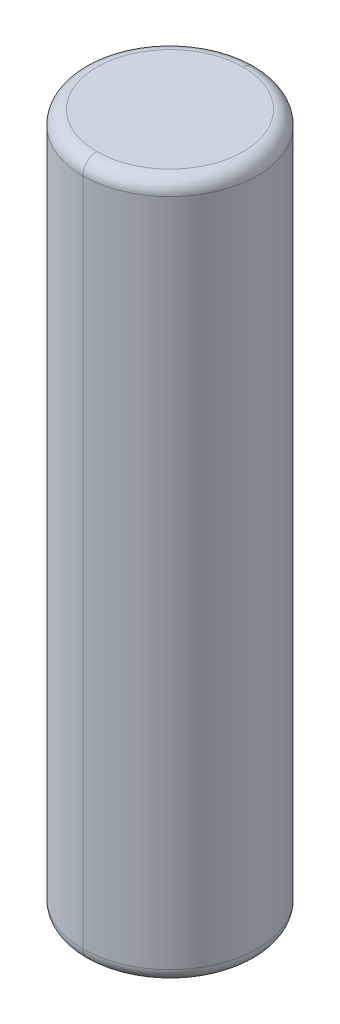
ISO-10303-21;
HEADER;
FILE_DESCRIPTION(('STEP AP214'),'2;1');
FILE_NAME('part.step','',(''),(''),'','','');
FILE_SCHEMA(('AUTOMOTIVE_DESIGN { 1 0 10303 214 1 1 1 1 }'));
ENDSEC;
DATA;
#1=APPLICATION_CONTEXT('core data for automotive mechanical design processes');
#2=APPLICATION_PROTOCOL_DEFINITION('international standard','automotive_design',2000,#1);
#3=PRODUCT_CONTEXT('',#1,'mechanical');
#4=PRODUCT('Part','Part','',(#3));
#5=PRODUCT_RELATED_PRODUCT_CATEGORY('part','',(#4));
#6=PRODUCT_DEFINITION_FORMATION('','',#4);
#7=PRODUCT_DEFINITION_CONTEXT('part definition',#1,'design');
#8=PRODUCT_DEFINITION('design','',#6,#7);
#9=PRODUCT_DEFINITION_SHAPE('','',#8);
#10=(LENGTH_UNIT() NAMED_UNIT(*) SI_UNIT(.MILLI.,.METRE.));
#11=(NAMED_UNIT(*) PLANE_ANGLE_UNIT() SI_UNIT($,.RADIAN.));
#12=(NAMED_UNIT(*) SI_UNIT($,.STERADIAN.) SOLID_ANGLE_UNIT());
#13=UNCERTAINTY_MEASURE_WITH_UNIT(LENGTH_MEASURE(1.E-05),#10,'distance_accuracy_value','');
#14=(GEOMETRIC_REPRESENTATION_CONTEXT(3) GLOBAL_UNCERTAINTY_ASSIGNED_CONTEXT((#13)) GLOBAL_UNIT_ASSIGNED_CONTEXT((#10,
#11,#12)) REPRESENTATION_CONTEXT('',''));
#15=CARTESIAN_POINT('',(0.,0.,0.));
#16=DIRECTION('',(0.,0.,1.));
#17=DIRECTION('',(1.,0.,0.));
#18=AXIS2_PLACEMENT_3D('',#15,#16,#17);
#19=CARTESIAN_POINT('',(0.,25.4,0.));
#20=DIRECTION('',(0.,-1.,0.));
#21=DIRECTION('',(0.,0.,-1.));
#22=AXIS2_PLACEMENT_3D('',#19,#20,#21);
#23=CYLINDRICAL_SURFACE('',#22,3.175);
#24=DIRECTION('',(0.,-1.,0.));
#25=VECTOR('',#24,1.);
#26=CARTESIAN_POINT('',(0.,25.4,3.175));
#27=LINE('',#26,#25);
#28=CARTESIAN_POINT('',(0.,24.892,3.175));
#29=VERTEX_POINT('',#28);
#30=CARTESIAN_POINT('',(0.,0.508000000000008,3.175));
#31=VERTEX_POINT('',#30);
#32=EDGE_CURVE('E118',#29,#31,#27,.T.);
#33=ORIENTED_EDGE('',*,*,#32,.F.);
#34=CARTESIAN_POINT('',(0.,24.892,0.));
#35=DIRECTION('',(0.,-1.,0.));
#36=DIRECTION('',(0.,0.,-1.));
#37=AXIS2_PLACEMENT_3D('',#34,#35,#36);
#38=CIRCLE('',#37,3.175);
#39=CARTESIAN_POINT('',(0.,24.892,-3.175));
#40=VERTEX_POINT('',#39);
#41=EDGE_CURVE('E74',#29,#40,#38,.T.);
#42=ORIENTED_EDGE('',*,*,#41,.T.);
#43=DIRECTION('',(0.,-1.,0.));
#44=VECTOR('',#43,1.);
#45=CARTESIAN_POINT('',(0.,25.4,-3.175));
#46=LINE('',#45,#44);
#47=CARTESIAN_POINT('',(0.,0.508000000000008,-3.175));
#48=VERTEX_POINT('',#47);
#49=EDGE_CURVE('E95',#40,#48,#46,.T.);
#50=ORIENTED_EDGE('',*,*,#49,.T.);
#51=CARTESIAN_POINT('',(0.,0.508000000000008,0.));
#52=DIRECTION('',(0.,-1.,0.));
#53=DIRECTION('',(0.,0.,-1.));
#54=AXIS2_PLACEMENT_3D('',#51,#52,#53);
#55=CIRCLE('',#54,3.175);
#56=EDGE_CURVE('E11',#31,#48,#55,.T.);
#57=ORIENTED_EDGE('',*,*,#56,.F.);
#58=EDGE_LOOP('',(#33,#42,#50,#57));
#59=FACE_BOUND('',#58,.T.);
#60=ADVANCED_FACE('F16',(#59),#23,.T.);
#61=CARTESIAN_POINT('',(0.,0.508000000000008,0.));
#62=DIRECTION('',(0.,-1.,0.));
#63=DIRECTION('',(0.,0.,-1.));
#64=AXIS2_PLACEMENT_3D('',#61,#62,#63);
#65=TOROIDAL_SURFACE('',#64,2.667,0.508);
#66=CARTESIAN_POINT('',(0.,0.508000000000008,2.667));
#67=DIRECTION('',(1.,0.,0.));
#68=DIRECTION('',(0.,0.,-1.));
#69=AXIS2_PLACEMENT_3D('',#66,#67,#68);
#70=CIRCLE('',#69,0.508);
#71=CARTESIAN_POINT('',(0.,0.,2.667));
#72=VERTEX_POINT('',#71);
#73=EDGE_CURVE('E83',#31,#72,#70,.T.);
#74=ORIENTED_EDGE('',*,*,#73,.F.);
#75=ORIENTED_EDGE('',*,*,#56,.T.);
#76=CARTESIAN_POINT('',(0.,0.508000000000008,-2.667));
#77=DIRECTION('',(-1.,0.,0.));
#78=DIRECTION('',(0.,0.,1.));
#79=AXIS2_PLACEMENT_3D('',#76,#77,#78);
#80=CIRCLE('',#79,0.508);
#81=CARTESIAN_POINT('',(0.,0.,-2.667));
#82=VERTEX_POINT('',#81);
#83=EDGE_CURVE('E80',#48,#82,#80,.T.);
#84=ORIENTED_EDGE('',*,*,#83,.T.);
#85=CARTESIAN_POINT('',(0.,0.,0.));
#86=DIRECTION('',(0.,-1.,0.));
#87=DIRECTION('',(0.,0.,-1.));
#88=AXIS2_PLACEMENT_3D('',#85,#86,#87);
#89=CIRCLE('',#88,2.667);
#90=EDGE_CURVE('E20',#72,#82,#89,.T.);
#91=ORIENTED_EDGE('',*,*,#90,.F.);
#92=EDGE_LOOP('',(#74,#75,#84,#91));
#93=FACE_BOUND('',#92,.T.);
#94=ADVANCED_FACE('F18',(#93),#65,.T.);
#95=CARTESIAN_POINT('',(0.,0.,0.));
#96=DIRECTION('',(0.,-1.,0.));
#97=DIRECTION('',(0.,0.,-1.));
#98=AXIS2_PLACEMENT_3D('',#95,#96,#97);
#99=PLANE('',#98);
#100=CARTESIAN_POINT('',(0.,0.,0.));
#101=DIRECTION('',(0.,-1.,0.));
#102=DIRECTION('',(0.,0.,-1.));
#103=AXIS2_PLACEMENT_3D('',#100,#101,#102);
#104=CIRCLE('',#103,2.667);
#105=EDGE_CURVE('E66',#82,#72,#104,.T.);
#106=ORIENTED_EDGE('',*,*,#105,.T.);
#107=ORIENTED_EDGE('',*,*,#90,.T.);
#108=EDGE_LOOP('',(#106,#107));
#109=FACE_BOUND('',#108,.T.);
#110=ADVANCED_FACE('F67',(#109),#99,.T.);
#111=CARTESIAN_POINT('',(2.66699999999996,25.4,0.));
#112=DIRECTION('',(0.,1.,0.));
#113=DIRECTION('',(1.,0.,0.));
#114=AXIS2_PLACEMENT_3D('',#111,#112,#113);
#115=PLANE('',#114);
#116=CARTESIAN_POINT('',(0.,25.4,0.));
#117=DIRECTION('',(0.,-1.,0.));
#118=DIRECTION('',(0.,0.,-1.));
#119=AXIS2_PLACEMENT_3D('',#116,#117,#118);
#120=CIRCLE('',#119,2.667);
#121=CARTESIAN_POINT('',(0.,25.4,-2.667));
#122=VERTEX_POINT('',#121);
#123=CARTESIAN_POINT('',(0.,25.4,2.667));
#124=VERTEX_POINT('',#123);
#125=EDGE_CURVE('E85',#122,#124,#120,.T.);
#126=ORIENTED_EDGE('',*,*,#125,.F.);
#127=CARTESIAN_POINT('',(0.,25.4,0.));
#128=DIRECTION('',(0.,-1.,0.));
#129=DIRECTION('',(0.,0.,-1.));
#130=AXIS2_PLACEMENT_3D('',#127,#128,#129);
#131=CIRCLE('',#130,2.667);
#132=EDGE_CURVE('E39',#124,#122,#131,.T.);
#133=ORIENTED_EDGE('',*,*,#132,.F.);
#134=EDGE_LOOP('',(#126,#133));
#135=FACE_BOUND('',#134,.T.);
#136=ADVANCED_FACE('F219',(#135),#115,.T.);
#137=CARTESIAN_POINT('',(0.,24.892,0.));
#138=DIRECTION('',(0.,-1.,0.));
#139=DIRECTION('',(0.,0.,-1.));
#140=AXIS2_PLACEMENT_3D('',#137,#138,#139);
#141=TOROIDAL_SURFACE('',#140,2.667,0.508);
#142=CARTESIAN_POINT('',(0.,24.892,2.667));
#143=DIRECTION('',(1.,0.,0.));
#144=DIRECTION('',(0.,0.,-1.));
#145=AXIS2_PLACEMENT_3D('',#142,#143,#144);
#146=CIRCLE('',#145,0.508);
#147=EDGE_CURVE('E100',#124,#29,#146,.T.);
#148=ORIENTED_EDGE('',*,*,#147,.F.);
#149=ORIENTED_EDGE('',*,*,#132,.T.);
#150=CARTESIAN_POINT('',(0.,24.892,-2.667));
#151=DIRECTION('',(-1.,0.,0.));
#152=DIRECTION('',(0.,0.,1.));
#153=AXIS2_PLACEMENT_3D('',#150,#151,#152);
#154=CIRCLE('',#153,0.508);
#155=EDGE_CURVE('E101',#122,#40,#154,.T.);
#156=ORIENTED_EDGE('',*,*,#155,.T.);
#157=ORIENTED_EDGE('',*,*,#41,.F.);
#158=EDGE_LOOP('',(#148,#149,#156,#157));
#159=FACE_BOUND('',#158,.T.);
#160=ADVANCED_FACE('F223',(#159),#141,.T.);
#161=CARTESIAN_POINT('',(0.,24.892,0.));
#162=DIRECTION('',(0.,-1.,0.));
#163=DIRECTION('',(0.,0.,-1.));
#164=AXIS2_PLACEMENT_3D('',#161,#162,#163);
#165=TOROIDAL_SURFACE('',#164,2.667,0.508);
#166=ORIENTED_EDGE('',*,*,#125,.T.);
#167=ORIENTED_EDGE('',*,*,#147,.T.);
#168=CARTESIAN_POINT('',(0.,24.892,0.));
#169=DIRECTION('',(0.,-1.,0.));
#170=DIRECTION('',(0.,0.,-1.));
#171=AXIS2_PLACEMENT_3D('',#168,#169,#170);
#172=CIRCLE('',#171,3.175);
#173=EDGE_CURVE('E117',#40,#29,#172,.T.);
#174=ORIENTED_EDGE('',*,*,#173,.F.);
#175=ORIENTED_EDGE('',*,*,#155,.F.);
#176=EDGE_LOOP('',(#166,#167,#174,#175));
#177=FACE_BOUND('',#176,.T.);
#178=ADVANCED_FACE('F213',(#177),#165,.T.);
#179=CARTESIAN_POINT('',(0.,0.508000000000008,0.));
#180=DIRECTION('',(0.,-1.,0.));
#181=DIRECTION('',(0.,0.,-1.));
#182=AXIS2_PLACEMENT_3D('',#179,#180,#181);
#183=TOROIDAL_SURFACE('',#182,2.667,0.508);
#184=CARTESIAN_POINT('',(0.,0.508000000000008,0.));
#185=DIRECTION('',(0.,-1.,0.));
#186=DIRECTION('',(0.,0.,-1.));
#187=AXIS2_PLACEMENT_3D('',#184,#185,#186);
#188=CIRCLE('',#187,3.175);
#189=EDGE_CURVE('E124',#48,#31,#188,.T.);
#190=ORIENTED_EDGE('',*,*,#189,.T.);
#191=ORIENTED_EDGE('',*,*,#73,.T.);
#192=ORIENTED_EDGE('',*,*,#105,.F.);
#193=ORIENTED_EDGE('',*,*,#83,.F.);
#194=EDGE_LOOP('',(#190,#191,#192,#193));
#195=FACE_BOUND('',#194,.T.);
#196=ADVANCED_FACE('F81',(#195),#183,.T.);
#197=CARTESIAN_POINT('',(0.,25.4,0.));
#198=DIRECTION('',(0.,-1.,0.));
#199=DIRECTION('',(0.,0.,-1.));
#200=AXIS2_PLACEMENT_3D('',#197,#198,#199);
#201=CYLINDRICAL_SURFACE('',#200,3.175);
#202=ORIENTED_EDGE('',*,*,#173,.T.);
#203=ORIENTED_EDGE('',*,*,#32,.T.);
#204=ORIENTED_EDGE('',*,*,#189,.F.);
#205=ORIENTED_EDGE('',*,*,#49,.F.);
#206=EDGE_LOOP('',(#202,#203,#204,#205));
#207=FACE_BOUND('',#206,.T.);
#208=ADVANCED_FACE('F137',(#207),#201,.T.);
#209=CLOSED_SHELL('',(#60,#94,#110,#136,#160,#178,#196,#208));
#210=MANIFOLD_SOLID_BREP('B1',#209);
#211=ADVANCED_BREP_SHAPE_REPRESENTATION('',(#18,#210),#14);
#212=SHAPE_DEFINITION_REPRESENTATION(#9,#211);
ENDSEC;
END-ISO-10303-21;
